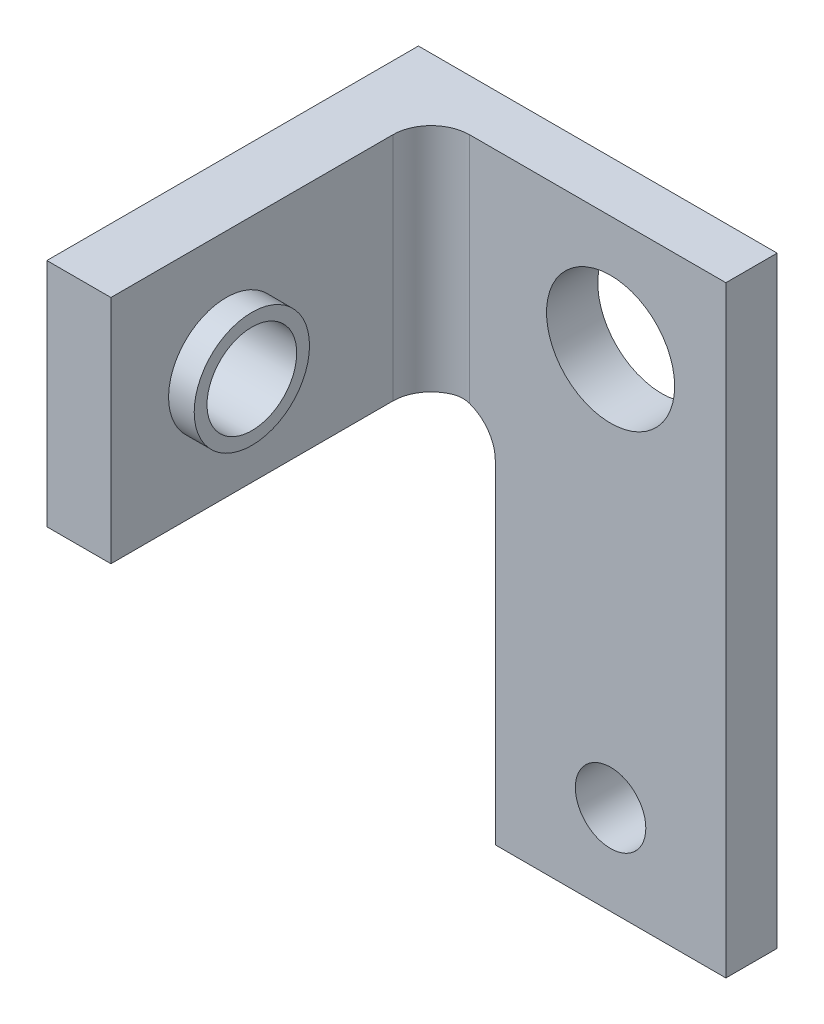
ISO-10303-21;
HEADER;
FILE_DESCRIPTION(('STEP AP214'),'2;1');
FILE_NAME('part.step','',(''),(''),'','','');
FILE_SCHEMA(('AUTOMOTIVE_DESIGN { 1 0 10303 214 1 1 1 1 }'));
ENDSEC;
DATA;
#1=APPLICATION_CONTEXT('core data for automotive mechanical design processes');
#2=APPLICATION_PROTOCOL_DEFINITION('international standard','automotive_design',2000,#1);
#3=PRODUCT_CONTEXT('',#1,'mechanical');
#4=PRODUCT('Part','Part','',(#3));
#5=PRODUCT_RELATED_PRODUCT_CATEGORY('part','',(#4));
#6=PRODUCT_DEFINITION_FORMATION('','',#4);
#7=PRODUCT_DEFINITION_CONTEXT('part definition',#1,'design');
#8=PRODUCT_DEFINITION('design','',#6,#7);
#9=PRODUCT_DEFINITION_SHAPE('','',#8);
#10=(LENGTH_UNIT() NAMED_UNIT(*) SI_UNIT(.MILLI.,.METRE.));
#11=(NAMED_UNIT(*) PLANE_ANGLE_UNIT() SI_UNIT($,.RADIAN.));
#12=(NAMED_UNIT(*) SI_UNIT($,.STERADIAN.) SOLID_ANGLE_UNIT());
#13=UNCERTAINTY_MEASURE_WITH_UNIT(LENGTH_MEASURE(1.E-05),#10,'distance_accuracy_value','');
#14=(GEOMETRIC_REPRESENTATION_CONTEXT(3) GLOBAL_UNCERTAINTY_ASSIGNED_CONTEXT((#13)) GLOBAL_UNIT_ASSIGNED_CONTEXT((#10,
#11,#12)) REPRESENTATION_CONTEXT('',''));
#15=CARTESIAN_POINT('',(0.,0.,0.));
#16=DIRECTION('',(0.,0.,1.));
#17=DIRECTION('',(1.,0.,0.));
#18=AXIS2_PLACEMENT_3D('',#15,#16,#17);
#19=CARTESIAN_POINT('',(0.,0.,2.));
#20=DIRECTION('',(0.,0.,-1.));
#21=DIRECTION('',(-1.,0.,0.));
#22=AXIS2_PLACEMENT_3D('',#19,#20,#21);
#23=PLANE('',#22);
#24=CARTESIAN_POINT('',(0.,-9.,2.));
#25=DIRECTION('',(0.,0.,1.));
#26=DIRECTION('',(1.,0.,0.));
#27=AXIS2_PLACEMENT_3D('',#24,#25,#26);
#28=CIRCLE('',#27,1.375);
#29=CARTESIAN_POINT('',(1.375,-9.,2.));
#30=VERTEX_POINT('',#29);
#31=EDGE_CURVE('E177',#30,#30,#28,.T.);
#32=ORIENTED_EDGE('',*,*,#31,.F.);
#33=EDGE_LOOP('',(#32));
#34=FACE_BOUND('',#33,.T.);
#35=CARTESIAN_POINT('',(0.,6.5,2.));
#36=DIRECTION('',(0.,0.,1.));
#37=DIRECTION('',(1.,0.,0.));
#38=AXIS2_PLACEMENT_3D('',#35,#36,#37);
#39=CIRCLE('',#38,2.5);
#40=CARTESIAN_POINT('',(2.5,6.5,2.));
#41=VERTEX_POINT('',#40);
#42=EDGE_CURVE('E181',#41,#41,#39,.T.);
#43=ORIENTED_EDGE('',*,*,#42,.F.);
#44=EDGE_LOOP('',(#43));
#45=FACE_BOUND('',#44,.T.);
#46=DIRECTION('',(-1.,0.,0.));
#47=VECTOR('',#46,1.);
#48=CARTESIAN_POINT('',(-4.5,11.,2.));
#49=LINE('',#48,#47);
#50=CARTESIAN_POINT('',(4.5,11.,2.));
#51=VERTEX_POINT('',#50);
#52=CARTESIAN_POINT('',(-5.5,11.,2.));
#53=VERTEX_POINT('',#52);
#54=EDGE_CURVE('E191',#51,#53,#49,.T.);
#55=ORIENTED_EDGE('',*,*,#54,.T.);
#56=DIRECTION('',(0.,1.,0.));
#57=VECTOR('',#56,1.);
#58=CARTESIAN_POINT('',(-5.5,2.,2.));
#59=LINE('',#58,#57);
#60=CARTESIAN_POINT('',(-5.5,1.91421356237312,2.));
#61=VERTEX_POINT('',#60);
#62=EDGE_CURVE('E49',#53,#61,#59,.F.);
#63=ORIENTED_EDGE('',*,*,#62,.T.);
#64=CARTESIAN_POINT('',(-6.,0.5,2.));
#65=DIRECTION('',(0.,0.,-1.));
#66=DIRECTION('',(-1.,0.,0.));
#67=AXIS2_PLACEMENT_3D('',#64,#65,#66);
#68=CIRCLE('',#67,1.5);
#69=CARTESIAN_POINT('',(-4.5,0.5,2.));
#70=VERTEX_POINT('',#69);
#71=EDGE_CURVE('E42',#61,#70,#68,.T.);
#72=ORIENTED_EDGE('',*,*,#71,.T.);
#73=DIRECTION('',(0.,-1.,0.));
#74=VECTOR('',#73,1.);
#75=CARTESIAN_POINT('',(-4.5,-11.,2.));
#76=LINE('',#75,#74);
#77=CARTESIAN_POINT('',(-4.5,-12.5,2.));
#78=VERTEX_POINT('',#77);
#79=EDGE_CURVE('E193',#70,#78,#76,.T.);
#80=ORIENTED_EDGE('',*,*,#79,.T.);
#81=DIRECTION('',(-1.,0.,0.));
#82=VECTOR('',#81,1.);
#83=CARTESIAN_POINT('',(-4.5,-12.5,2.));
#84=LINE('',#83,#82);
#85=CARTESIAN_POINT('',(4.5,-12.5,2.));
#86=VERTEX_POINT('',#85);
#87=EDGE_CURVE('E134',#86,#78,#84,.T.);
#88=ORIENTED_EDGE('',*,*,#87,.F.);
#89=DIRECTION('',(0.,1.,0.));
#90=VECTOR('',#89,1.);
#91=CARTESIAN_POINT('',(4.5,-11.,2.));
#92=LINE('',#91,#90);
#93=EDGE_CURVE('E118',#86,#51,#92,.T.);
#94=ORIENTED_EDGE('',*,*,#93,.T.);
#95=EDGE_LOOP('',(#55,#63,#72,#80,#88,#94));
#96=FACE_BOUND('',#95,.T.);
#97=ADVANCED_FACE('F33',(#34,#45,#96),#23,.F.);
#98=CARTESIAN_POINT('',(-4.5,-11.,2.));
#99=DIRECTION('',(1.,0.,0.));
#100=DIRECTION('',(0.,0.,-1.));
#101=AXIS2_PLACEMENT_3D('',#98,#99,#100);
#102=PLANE('',#101);
#103=ORIENTED_EDGE('',*,*,#79,.F.);
#104=DIRECTION('',(0.,0.,1.));
#105=VECTOR('',#104,1.);
#106=CARTESIAN_POINT('',(-4.5,0.499999999999998,0.));
#107=LINE('',#106,#105);
#108=CARTESIAN_POINT('',(-4.5,0.499999999999999,0.));
#109=VERTEX_POINT('',#108);
#110=EDGE_CURVE('E115',#70,#109,#107,.F.);
#111=ORIENTED_EDGE('',*,*,#110,.T.);
#112=DIRECTION('',(0.,-1.,0.));
#113=VECTOR('',#112,1.);
#114=CARTESIAN_POINT('',(-4.5,-11.,0.));
#115=LINE('',#114,#113);
#116=CARTESIAN_POINT('',(-4.5,-12.5,0.));
#117=VERTEX_POINT('',#116);
#118=EDGE_CURVE('E109',#109,#117,#115,.T.);
#119=ORIENTED_EDGE('',*,*,#118,.T.);
#120=DIRECTION('',(0.,0.,-1.));
#121=VECTOR('',#120,1.);
#122=CARTESIAN_POINT('',(-4.5,-12.5,2.));
#123=LINE('',#122,#121);
#124=EDGE_CURVE('E113',#78,#117,#123,.T.);
#125=ORIENTED_EDGE('',*,*,#124,.F.);
#126=EDGE_LOOP('',(#103,#111,#119,#125));
#127=FACE_BOUND('',#126,.T.);
#128=ADVANCED_FACE('F111',(#127),#102,.F.);
#129=CARTESIAN_POINT('',(4.5,-11.,2.));
#130=DIRECTION('',(-1.,0.,0.));
#131=DIRECTION('',(0.,0.,1.));
#132=AXIS2_PLACEMENT_3D('',#129,#130,#131);
#133=PLANE('',#132);
#134=DIRECTION('',(0.,1.,0.));
#135=VECTOR('',#134,1.);
#136=CARTESIAN_POINT('',(4.5,-11.,0.));
#137=LINE('',#136,#135);
#138=CARTESIAN_POINT('',(4.5,-12.5,0.));
#139=VERTEX_POINT('',#138);
#140=CARTESIAN_POINT('',(4.5,11.,0.));
#141=VERTEX_POINT('',#140);
#142=EDGE_CURVE('E125',#139,#141,#137,.T.);
#143=ORIENTED_EDGE('',*,*,#142,.T.);
#144=DIRECTION('',(0.,0.,-1.));
#145=VECTOR('',#144,1.);
#146=CARTESIAN_POINT('',(4.5,11.,2.));
#147=LINE('',#146,#145);
#148=EDGE_CURVE('E195',#51,#141,#147,.T.);
#149=ORIENTED_EDGE('',*,*,#148,.F.);
#150=ORIENTED_EDGE('',*,*,#93,.F.);
#151=DIRECTION('',(0.,0.,1.));
#152=VECTOR('',#151,1.);
#153=CARTESIAN_POINT('',(4.5,-12.5,2.));
#154=LINE('',#153,#152);
#155=EDGE_CURVE('E129',#139,#86,#154,.T.);
#156=ORIENTED_EDGE('',*,*,#155,.F.);
#157=EDGE_LOOP('',(#143,#149,#150,#156));
#158=FACE_BOUND('',#157,.T.);
#159=ADVANCED_FACE('F229',(#158),#133,.F.);
#160=CARTESIAN_POINT('',(-4.5,11.,2.));
#161=DIRECTION('',(0.,-1.,0.));
#162=DIRECTION('',(0.,0.,-1.));
#163=AXIS2_PLACEMENT_3D('',#160,#161,#162);
#164=PLANE('',#163);
#165=DIRECTION('',(-1.,0.,0.));
#166=VECTOR('',#165,1.);
#167=CARTESIAN_POINT('',(-4.5,11.,0.));
#168=LINE('',#167,#166);
#169=CARTESIAN_POINT('',(-9.5,11.,0.));
#170=VERTEX_POINT('',#169);
#171=EDGE_CURVE('E119',#141,#170,#168,.T.);
#172=ORIENTED_EDGE('',*,*,#171,.T.);
#173=DIRECTION('',(0.,0.,-1.));
#174=VECTOR('',#173,1.);
#175=CARTESIAN_POINT('',(-9.5,11.,2.));
#176=LINE('',#175,#174);
#177=CARTESIAN_POINT('',(-9.5,11.,14.5));
#178=VERTEX_POINT('',#177);
#179=EDGE_CURVE('E167',#178,#170,#176,.T.);
#180=ORIENTED_EDGE('',*,*,#179,.F.);
#181=DIRECTION('',(-1.,0.,0.));
#182=VECTOR('',#181,1.);
#183=CARTESIAN_POINT('',(-9.5,11.,14.5));
#184=LINE('',#183,#182);
#185=CARTESIAN_POINT('',(-7.,11.,14.5));
#186=VERTEX_POINT('',#185);
#187=EDGE_CURVE('E158',#186,#178,#184,.T.);
#188=ORIENTED_EDGE('',*,*,#187,.F.);
#189=DIRECTION('',(0.,0.,-1.));
#190=VECTOR('',#189,1.);
#191=CARTESIAN_POINT('',(-7.,11.,14.5));
#192=LINE('',#191,#190);
#193=CARTESIAN_POINT('',(-7.,11.,3.5));
#194=VERTEX_POINT('',#193);
#195=EDGE_CURVE('E161',#186,#194,#192,.T.);
#196=ORIENTED_EDGE('',*,*,#195,.T.);
#197=CARTESIAN_POINT('',(-5.5,11.,3.5));
#198=DIRECTION('',(0.,-1.,0.));
#199=DIRECTION('',(0.,0.,-1.));
#200=AXIS2_PLACEMENT_3D('',#197,#198,#199);
#201=CIRCLE('',#200,1.5);
#202=EDGE_CURVE('E210',#194,#53,#201,.T.);
#203=ORIENTED_EDGE('',*,*,#202,.T.);
#204=ORIENTED_EDGE('',*,*,#54,.F.);
#205=ORIENTED_EDGE('',*,*,#148,.T.);
#206=EDGE_LOOP('',(#172,#180,#188,#196,#203,#204,#205));
#207=FACE_BOUND('',#206,.T.);
#208=ADVANCED_FACE('F232',(#207),#164,.F.);
#209=CARTESIAN_POINT('',(0.,0.,0.));
#210=DIRECTION('',(0.,0.,-1.));
#211=DIRECTION('',(-1.,0.,0.));
#212=AXIS2_PLACEMENT_3D('',#209,#210,#211);
#213=PLANE('',#212);
#214=CARTESIAN_POINT('',(0.,6.5,0.));
#215=DIRECTION('',(0.,0.,1.));
#216=DIRECTION('',(1.,0.,0.));
#217=AXIS2_PLACEMENT_3D('',#214,#215,#216);
#218=CIRCLE('',#217,2.5);
#219=CARTESIAN_POINT('',(2.5,6.5,0.));
#220=VERTEX_POINT('',#219);
#221=EDGE_CURVE('E178',#220,#220,#218,.T.);
#222=ORIENTED_EDGE('',*,*,#221,.T.);
#223=EDGE_LOOP('',(#222));
#224=FACE_BOUND('',#223,.T.);
#225=CARTESIAN_POINT('',(0.,-9.,0.));
#226=DIRECTION('',(0.,0.,1.));
#227=DIRECTION('',(1.,0.,0.));
#228=AXIS2_PLACEMENT_3D('',#225,#226,#227);
#229=CIRCLE('',#228,1.375);
#230=CARTESIAN_POINT('',(1.375,-9.,0.));
#231=VERTEX_POINT('',#230);
#232=EDGE_CURVE('E184',#231,#231,#229,.T.);
#233=ORIENTED_EDGE('',*,*,#232,.T.);
#234=EDGE_LOOP('',(#233));
#235=FACE_BOUND('',#234,.T.);
#236=ORIENTED_EDGE('',*,*,#142,.F.);
#237=DIRECTION('',(1.,0.,0.));
#238=VECTOR('',#237,1.);
#239=CARTESIAN_POINT('',(-4.5,-12.5,0.));
#240=LINE('',#239,#238);
#241=EDGE_CURVE('E122',#117,#139,#240,.T.);
#242=ORIENTED_EDGE('',*,*,#241,.F.);
#243=ORIENTED_EDGE('',*,*,#118,.F.);
#244=CARTESIAN_POINT('',(-6.,0.499999999999998,0.));
#245=DIRECTION('',(0.,0.,-1.));
#246=DIRECTION('',(-1.,0.,0.));
#247=AXIS2_PLACEMENT_3D('',#244,#245,#246);
#248=CIRCLE('',#247,1.5);
#249=CARTESIAN_POINT('',(-6.,2.,0.));
#250=VERTEX_POINT('',#249);
#251=EDGE_CURVE('E11',#109,#250,#248,.F.);
#252=ORIENTED_EDGE('',*,*,#251,.T.);
#253=DIRECTION('',(1.,0.,0.));
#254=VECTOR('',#253,1.);
#255=CARTESIAN_POINT('',(-9.5,2.,0.));
#256=LINE('',#255,#254);
#257=CARTESIAN_POINT('',(-9.5,2.,0.));
#258=VERTEX_POINT('',#257);
#259=EDGE_CURVE('E174',#258,#250,#256,.T.);
#260=ORIENTED_EDGE('',*,*,#259,.F.);
#261=DIRECTION('',(0.,-1.,0.));
#262=VECTOR('',#261,1.);
#263=CARTESIAN_POINT('',(-9.5,11.,0.));
#264=LINE('',#263,#262);
#265=EDGE_CURVE('E170',#170,#258,#264,.T.);
#266=ORIENTED_EDGE('',*,*,#265,.F.);
#267=ORIENTED_EDGE('',*,*,#171,.F.);
#268=EDGE_LOOP('',(#236,#242,#243,#252,#260,#266,#267));
#269=FACE_BOUND('',#268,.T.);
#270=ADVANCED_FACE('F123',(#224,#235,#269),#213,.T.);
#271=CARTESIAN_POINT('',(0.,-9.,0.));
#272=DIRECTION('',(0.,0.,1.));
#273=DIRECTION('',(1.,0.,0.));
#274=AXIS2_PLACEMENT_3D('',#271,#272,#273);
#275=CYLINDRICAL_SURFACE('',#274,1.375);
#276=ORIENTED_EDGE('',*,*,#232,.F.);
#277=EDGE_LOOP('',(#276));
#278=FACE_BOUND('',#277,.T.);
#279=ORIENTED_EDGE('',*,*,#31,.T.);
#280=EDGE_LOOP('',(#279));
#281=FACE_BOUND('',#280,.T.);
#282=ADVANCED_FACE('F241',(#278,#281),#275,.F.);
#283=CARTESIAN_POINT('',(0.,6.5,0.));
#284=DIRECTION('',(0.,0.,1.));
#285=DIRECTION('',(1.,0.,0.));
#286=AXIS2_PLACEMENT_3D('',#283,#284,#285);
#287=CYLINDRICAL_SURFACE('',#286,2.5);
#288=ORIENTED_EDGE('',*,*,#221,.F.);
#289=EDGE_LOOP('',(#288));
#290=FACE_BOUND('',#289,.T.);
#291=ORIENTED_EDGE('',*,*,#42,.T.);
#292=EDGE_LOOP('',(#291));
#293=FACE_BOUND('',#292,.T.);
#294=ADVANCED_FACE('F248',(#290,#293),#287,.F.);
#295=CARTESIAN_POINT('',(-9.5,2.,2.));
#296=DIRECTION('',(0.,1.,0.));
#297=DIRECTION('',(0.,0.,1.));
#298=AXIS2_PLACEMENT_3D('',#295,#296,#297);
#299=PLANE('',#298);
#300=ORIENTED_EDGE('',*,*,#259,.T.);
#301=DIRECTION('',(0.,0.,1.));
#302=VECTOR('',#301,1.);
#303=CARTESIAN_POINT('',(-6.,2.,2.));
#304=LINE('',#303,#302);
#305=CARTESIAN_POINT('',(-6.,2.,2.0857864376269));
#306=VERTEX_POINT('',#305);
#307=EDGE_CURVE('E214',#250,#306,#304,.T.);
#308=ORIENTED_EDGE('',*,*,#307,.T.);
#309=CARTESIAN_POINT('',(-5.5,2.,3.5));
#310=DIRECTION('',(0.,1.,0.));
#311=DIRECTION('',(0.,0.,1.));
#312=AXIS2_PLACEMENT_3D('',#309,#310,#311);
#313=CIRCLE('',#312,1.5);
#314=CARTESIAN_POINT('',(-7.,2.,3.5));
#315=VERTEX_POINT('',#314);
#316=EDGE_CURVE('E212',#306,#315,#313,.T.);
#317=ORIENTED_EDGE('',*,*,#316,.T.);
#318=DIRECTION('',(0.,0.,-1.));
#319=VECTOR('',#318,1.);
#320=CARTESIAN_POINT('',(-7.,2.,14.5));
#321=LINE('',#320,#319);
#322=CARTESIAN_POINT('',(-7.,2.,14.5));
#323=VERTEX_POINT('',#322);
#324=EDGE_CURVE('E164',#323,#315,#321,.T.);
#325=ORIENTED_EDGE('',*,*,#324,.F.);
#326=DIRECTION('',(1.,0.,0.));
#327=VECTOR('',#326,1.);
#328=CARTESIAN_POINT('',(-9.5,2.,14.5));
#329=LINE('',#328,#327);
#330=CARTESIAN_POINT('',(-9.5,2.,14.5));
#331=VERTEX_POINT('',#330);
#332=EDGE_CURVE('E154',#331,#323,#329,.T.);
#333=ORIENTED_EDGE('',*,*,#332,.F.);
#334=DIRECTION('',(0.,0.,1.));
#335=VECTOR('',#334,1.);
#336=CARTESIAN_POINT('',(-9.5,2.,2.));
#337=LINE('',#336,#335);
#338=EDGE_CURVE('E172',#258,#331,#337,.T.);
#339=ORIENTED_EDGE('',*,*,#338,.F.);
#340=EDGE_LOOP('',(#300,#308,#317,#325,#333,#339));
#341=FACE_BOUND('',#340,.T.);
#342=ADVANCED_FACE('F252',(#341),#299,.F.);
#343=CARTESIAN_POINT('',(-9.5,0.,0.));
#344=DIRECTION('',(1.,0.,0.));
#345=DIRECTION('',(0.,0.,-1.));
#346=AXIS2_PLACEMENT_3D('',#343,#344,#345);
#347=PLANE('',#346);
#348=CARTESIAN_POINT('',(-9.5,6.5,10.));
#349=DIRECTION('',(1.,0.,0.));
#350=DIRECTION('',(0.,0.,-1.));
#351=AXIS2_PLACEMENT_3D('',#348,#349,#350);
#352=CIRCLE('',#351,2.25);
#353=CARTESIAN_POINT('',(-9.5,6.5,7.75));
#354=VERTEX_POINT('',#353);
#355=EDGE_CURVE('E203',#354,#354,#352,.F.);
#356=ORIENTED_EDGE('',*,*,#355,.F.);
#357=EDGE_LOOP('',(#356));
#358=FACE_BOUND('',#357,.T.);
#359=ORIENTED_EDGE('',*,*,#338,.T.);
#360=DIRECTION('',(0.,-1.,0.));
#361=VECTOR('',#360,1.);
#362=CARTESIAN_POINT('',(-9.5,11.,14.5));
#363=LINE('',#362,#361);
#364=EDGE_CURVE('E151',#178,#331,#363,.T.);
#365=ORIENTED_EDGE('',*,*,#364,.F.);
#366=ORIENTED_EDGE('',*,*,#179,.T.);
#367=ORIENTED_EDGE('',*,*,#265,.T.);
#368=EDGE_LOOP('',(#359,#365,#366,#367));
#369=FACE_BOUND('',#368,.T.);
#370=ADVANCED_FACE('F256',(#358,#369),#347,.F.);
#371=CARTESIAN_POINT('',(-7.,11.,14.5));
#372=DIRECTION('',(-1.,0.,0.));
#373=DIRECTION('',(0.,-1.,0.));
#374=AXIS2_PLACEMENT_3D('',#371,#372,#373);
#375=PLANE('',#374);
#376=CARTESIAN_POINT('',(-7.,6.5,10.));
#377=DIRECTION('',(-1.,0.,0.));
#378=DIRECTION('',(0.,-1.,0.));
#379=AXIS2_PLACEMENT_3D('',#376,#377,#378);
#380=CIRCLE('',#379,2.25);
#381=CARTESIAN_POINT('',(-7.,4.25,10.));
#382=VERTEX_POINT('',#381);
#383=EDGE_CURVE('E200',#382,#382,#380,.F.);
#384=ORIENTED_EDGE('',*,*,#383,.F.);
#385=EDGE_LOOP('',(#384));
#386=FACE_BOUND('',#385,.T.);
#387=ORIENTED_EDGE('',*,*,#324,.T.);
#388=DIRECTION('',(0.,1.,0.));
#389=VECTOR('',#388,1.);
#390=CARTESIAN_POINT('',(-7.,11.,3.5));
#391=LINE('',#390,#389);
#392=EDGE_CURVE('E206',#315,#194,#391,.T.);
#393=ORIENTED_EDGE('',*,*,#392,.T.);
#394=ORIENTED_EDGE('',*,*,#195,.F.);
#395=DIRECTION('',(0.,1.,0.));
#396=VECTOR('',#395,1.);
#397=CARTESIAN_POINT('',(-7.,11.,14.5));
#398=LINE('',#397,#396);
#399=EDGE_CURVE('E156',#323,#186,#398,.T.);
#400=ORIENTED_EDGE('',*,*,#399,.F.);
#401=EDGE_LOOP('',(#387,#393,#394,#400));
#402=FACE_BOUND('',#401,.T.);
#403=ADVANCED_FACE('F260',(#386,#402),#375,.F.);
#404=CARTESIAN_POINT('',(0.,0.,14.5));
#405=DIRECTION('',(0.,0.,1.));
#406=DIRECTION('',(1.,0.,0.));
#407=AXIS2_PLACEMENT_3D('',#404,#405,#406);
#408=PLANE('',#407);
#409=ORIENTED_EDGE('',*,*,#364,.T.);
#410=ORIENTED_EDGE('',*,*,#332,.T.);
#411=ORIENTED_EDGE('',*,*,#399,.T.);
#412=ORIENTED_EDGE('',*,*,#187,.T.);
#413=EDGE_LOOP('',(#409,#410,#411,#412));
#414=FACE_BOUND('',#413,.T.);
#415=ADVANCED_FACE('F264',(#414),#408,.T.);
#416=CARTESIAN_POINT('',(-9.5,6.5,10.));
#417=DIRECTION('',(1.,0.,0.));
#418=DIRECTION('',(0.,1.,0.));
#419=AXIS2_PLACEMENT_3D('',#416,#417,#418);
#420=CYLINDRICAL_SURFACE('',#419,1.75);
#421=CARTESIAN_POINT('',(-6.,6.5,10.));
#422=DIRECTION('',(1.,0.,0.));
#423=DIRECTION('',(0.,1.,0.));
#424=AXIS2_PLACEMENT_3D('',#421,#422,#423);
#425=CIRCLE('',#424,1.75);
#426=CARTESIAN_POINT('',(-6.,8.25,10.));
#427=VERTEX_POINT('',#426);
#428=EDGE_CURVE('E145',#427,#427,#425,.T.);
#429=ORIENTED_EDGE('',*,*,#428,.T.);
#430=EDGE_LOOP('',(#429));
#431=FACE_BOUND('',#430,.T.);
#432=CARTESIAN_POINT('',(-10.5,6.5,10.));
#433=DIRECTION('',(-1.,0.,0.));
#434=DIRECTION('',(0.,0.,1.));
#435=AXIS2_PLACEMENT_3D('',#432,#433,#434);
#436=CIRCLE('',#435,1.75);
#437=CARTESIAN_POINT('',(-10.5,6.5,11.75));
#438=VERTEX_POINT('',#437);
#439=EDGE_CURVE('E139',#438,#438,#436,.T.);
#440=ORIENTED_EDGE('',*,*,#439,.T.);
#441=EDGE_LOOP('',(#440));
#442=FACE_BOUND('',#441,.T.);
#443=ADVANCED_FACE('F268',(#431,#442),#420,.F.);
#444=CARTESIAN_POINT('',(-6.,6.5,10.));
#445=DIRECTION('',(-1.,0.,0.));
#446=DIRECTION('',(0.,-1.,0.));
#447=AXIS2_PLACEMENT_3D('',#444,#445,#446);
#448=CYLINDRICAL_SURFACE('',#447,2.25);
#449=CARTESIAN_POINT('',(-6.,6.5,10.));
#450=DIRECTION('',(1.,0.,0.));
#451=DIRECTION('',(0.,1.,0.));
#452=AXIS2_PLACEMENT_3D('',#449,#450,#451);
#453=CIRCLE('',#452,2.25);
#454=CARTESIAN_POINT('',(-6.,8.75,10.));
#455=VERTEX_POINT('',#454);
#456=EDGE_CURVE('E148',#455,#455,#453,.T.);
#457=ORIENTED_EDGE('',*,*,#456,.F.);
#458=EDGE_LOOP('',(#457));
#459=FACE_BOUND('',#458,.T.);
#460=ORIENTED_EDGE('',*,*,#383,.T.);
#461=EDGE_LOOP('',(#460));
#462=FACE_BOUND('',#461,.T.);
#463=ADVANCED_FACE('F272',(#459,#462),#448,.T.);
#464=CARTESIAN_POINT('',(-6.,6.5,10.));
#465=DIRECTION('',(1.,0.,0.));
#466=DIRECTION('',(0.,1.,0.));
#467=AXIS2_PLACEMENT_3D('',#464,#465,#466);
#468=PLANE('',#467);
#469=ORIENTED_EDGE('',*,*,#428,.F.);
#470=EDGE_LOOP('',(#469));
#471=FACE_BOUND('',#470,.T.);
#472=ORIENTED_EDGE('',*,*,#456,.T.);
#473=EDGE_LOOP('',(#472));
#474=FACE_BOUND('',#473,.T.);
#475=ADVANCED_FACE('F276',(#471,#474),#468,.T.);
#476=CARTESIAN_POINT('',(-10.5,6.5,10.));
#477=DIRECTION('',(1.,0.,0.));
#478=DIRECTION('',(0.,0.,-1.));
#479=AXIS2_PLACEMENT_3D('',#476,#477,#478);
#480=CYLINDRICAL_SURFACE('',#479,2.25);
#481=CARTESIAN_POINT('',(-10.5,6.5,10.));
#482=DIRECTION('',(-1.,0.,0.));
#483=DIRECTION('',(0.,0.,1.));
#484=AXIS2_PLACEMENT_3D('',#481,#482,#483);
#485=CIRCLE('',#484,2.25);
#486=CARTESIAN_POINT('',(-10.5,6.5,12.25));
#487=VERTEX_POINT('',#486);
#488=EDGE_CURVE('E142',#487,#487,#485,.T.);
#489=ORIENTED_EDGE('',*,*,#488,.F.);
#490=EDGE_LOOP('',(#489));
#491=FACE_BOUND('',#490,.T.);
#492=ORIENTED_EDGE('',*,*,#355,.T.);
#493=EDGE_LOOP('',(#492));
#494=FACE_BOUND('',#493,.T.);
#495=ADVANCED_FACE('F280',(#491,#494),#480,.T.);
#496=CARTESIAN_POINT('',(-10.5,6.5,10.));
#497=DIRECTION('',(-1.,0.,0.));
#498=DIRECTION('',(0.,0.,1.));
#499=AXIS2_PLACEMENT_3D('',#496,#497,#498);
#500=PLANE('',#499);
#501=ORIENTED_EDGE('',*,*,#439,.F.);
#502=EDGE_LOOP('',(#501));
#503=FACE_BOUND('',#502,.T.);
#504=ORIENTED_EDGE('',*,*,#488,.T.);
#505=EDGE_LOOP('',(#504));
#506=FACE_BOUND('',#505,.T.);
#507=ADVANCED_FACE('F227',(#503,#506),#500,.T.);
#508=CARTESIAN_POINT('',(-5.5,11.,3.5));
#509=DIRECTION('',(0.,-1.,0.));
#510=DIRECTION('',(1.,0.,0.));
#511=AXIS2_PLACEMENT_3D('',#508,#509,#510);
#512=CYLINDRICAL_SURFACE('',#511,1.5);
#513=ORIENTED_EDGE('',*,*,#316,.F.);
#514=CARTESIAN_POINT('',(-6.,2.,2.0857864376269));
#515=CARTESIAN_POINT('',(-5.97078859182124,2.00000092684097,2.07545712574956));
#516=CARTESIAN_POINT('',(-5.94127072372959,1.99914520064403,2.06604218891018));
#517=CARTESIAN_POINT('',(-5.88179614999242,1.99563269949754,2.04907290479732));
#518=CARTESIAN_POINT('',(-5.85183924482113,1.99297507915228,2.04151943313763));
#519=CARTESIAN_POINT('',(-5.76287479847585,1.98231990004341,2.0219892960205));
#520=CARTESIAN_POINT('',(-5.70353147253191,1.97164573670506,2.01270799576775));
#521=CARTESIAN_POINT('',(-5.62050786164129,1.95141960143952,2.00464668533327));
#522=CARTESIAN_POINT('',(-5.59630177018209,1.94487363331994,2.0029000194108));
#523=CARTESIAN_POINT('',(-5.54799493396927,1.93049971198312,2.00057224638806));
#524=CARTESIAN_POINT('',(-5.52389676469752,1.92266149190395,2.00000101252718));
#525=CARTESIAN_POINT('',(-5.50000000000001,1.9142135623731,1.99999999999999));
#526=B_SPLINE_CURVE_WITH_KNOTS('',3,(#514,#515,#516,#517,#518,#519,#520,#521,#522,#523,#524,
#525),.UNSPECIFIED.,.F.,.F.,(4,2,2,2,2,4),(0.,0.0928906415550713,0.185824894850795,
0.367794606234118,0.44315974492103,0.519155383641059),.UNSPECIFIED.);
#527=EDGE_CURVE('E218',#306,#61,#526,.T.);
#528=ORIENTED_EDGE('',*,*,#527,.T.);
#529=ORIENTED_EDGE('',*,*,#62,.F.);
#530=ORIENTED_EDGE('',*,*,#202,.F.);
#531=ORIENTED_EDGE('',*,*,#392,.F.);
#532=EDGE_LOOP('',(#513,#528,#529,#530,#531));
#533=FACE_BOUND('',#532,.T.);
#534=ADVANCED_FACE('F223',(#533),#512,.F.);
#535=CARTESIAN_POINT('',(-6.,0.5,2.));
#536=DIRECTION('',(0.,0.,-1.));
#537=DIRECTION('',(0.,1.,0.));
#538=AXIS2_PLACEMENT_3D('',#535,#536,#537);
#539=CYLINDRICAL_SURFACE('',#538,1.5);
#540=ORIENTED_EDGE('',*,*,#251,.F.);
#541=ORIENTED_EDGE('',*,*,#110,.F.);
#542=ORIENTED_EDGE('',*,*,#71,.F.);
#543=ORIENTED_EDGE('',*,*,#527,.F.);
#544=ORIENTED_EDGE('',*,*,#307,.F.);
#545=EDGE_LOOP('',(#540,#541,#542,#543,#544));
#546=FACE_BOUND('',#545,.T.);
#547=ADVANCED_FACE('F35',(#546),#539,.F.);
#548=CARTESIAN_POINT('',(0.,-12.5,0.));
#549=DIRECTION('',(0.,-1.,0.));
#550=DIRECTION('',(0.,0.,-1.));
#551=AXIS2_PLACEMENT_3D('',#548,#549,#550);
#552=PLANE('',#551);
#553=ORIENTED_EDGE('',*,*,#124,.T.);
#554=ORIENTED_EDGE('',*,*,#241,.T.);
#555=ORIENTED_EDGE('',*,*,#155,.T.);
#556=ORIENTED_EDGE('',*,*,#87,.T.);
#557=EDGE_LOOP('',(#553,#554,#555,#556));
#558=FACE_BOUND('',#557,.T.);
#559=ADVANCED_FACE('F132',(#558),#552,.T.);
#560=CLOSED_SHELL('',(#97,#128,#159,#208,#270,#282,#294,#342,#370,#403,#415,#443,#463,#475,#495,
#507,#534,#547,#559));
#561=MANIFOLD_SOLID_BREP('B2',#560);
#562=ADVANCED_BREP_SHAPE_REPRESENTATION('',(#18,#561),#14);
#563=SHAPE_DEFINITION_REPRESENTATION(#9,#562);
ENDSEC;
END-ISO-10303-21;
